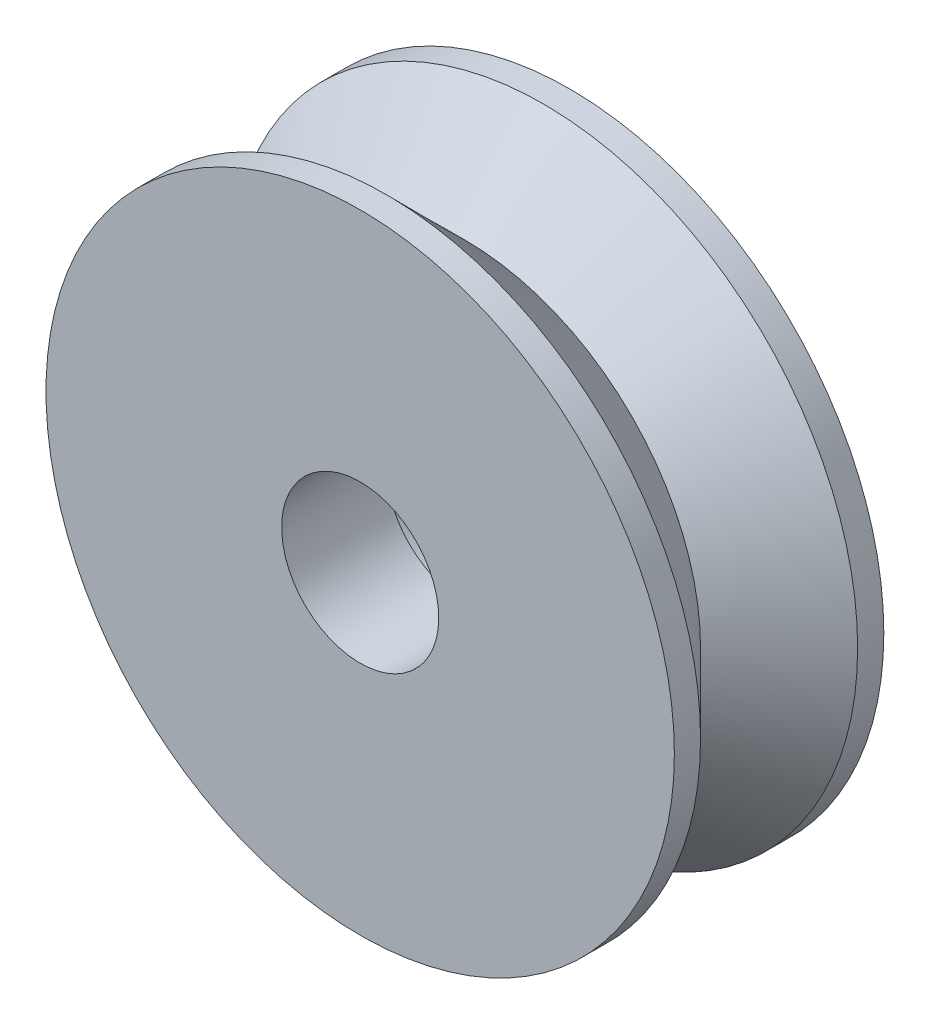
ISO-10303-21;
HEADER;
FILE_DESCRIPTION(('STEP AP214'),'2;1');
FILE_NAME('part.step','',(''),(''),'','','');
FILE_SCHEMA(('AUTOMOTIVE_DESIGN { 1 0 10303 214 1 1 1 1 }'));
ENDSEC;
DATA;
#1=APPLICATION_CONTEXT('core data for automotive mechanical design processes');
#2=APPLICATION_PROTOCOL_DEFINITION('international standard','automotive_design',2000,#1);
#3=PRODUCT_CONTEXT('',#1,'mechanical');
#4=PRODUCT('Part','Part','',(#3));
#5=PRODUCT_RELATED_PRODUCT_CATEGORY('part','',(#4));
#6=PRODUCT_DEFINITION_FORMATION('','',#4);
#7=PRODUCT_DEFINITION_CONTEXT('part definition',#1,'design');
#8=PRODUCT_DEFINITION('design','',#6,#7);
#9=PRODUCT_DEFINITION_SHAPE('','',#8);
#10=(LENGTH_UNIT() NAMED_UNIT(*) SI_UNIT(.MILLI.,.METRE.));
#11=(NAMED_UNIT(*) PLANE_ANGLE_UNIT() SI_UNIT($,.RADIAN.));
#12=(NAMED_UNIT(*) SI_UNIT($,.STERADIAN.) SOLID_ANGLE_UNIT());
#13=UNCERTAINTY_MEASURE_WITH_UNIT(LENGTH_MEASURE(1.E-05),#10,'distance_accuracy_value','');
#14=(GEOMETRIC_REPRESENTATION_CONTEXT(3) GLOBAL_UNCERTAINTY_ASSIGNED_CONTEXT((#13)) GLOBAL_UNIT_ASSIGNED_CONTEXT((#10,
#11,#12)) REPRESENTATION_CONTEXT('',''));
#15=CARTESIAN_POINT('',(0.,0.,0.));
#16=DIRECTION('',(0.,0.,1.));
#17=DIRECTION('',(1.,0.,0.));
#18=AXIS2_PLACEMENT_3D('',#15,#16,#17);
#19=CARTESIAN_POINT('',(0.,0.,0.));
#20=DIRECTION('',(0.,0.,1.));
#21=DIRECTION('',(1.,0.,0.));
#22=AXIS2_PLACEMENT_3D('',#19,#20,#21);
#23=PLANE('',#22);
#24=CARTESIAN_POINT('',(0.,0.,0.));
#25=DIRECTION('',(0.,0.,1.));
#26=DIRECTION('',(1.,0.,0.));
#27=AXIS2_PLACEMENT_3D('',#24,#25,#26);
#28=CIRCLE('',#27,5.99999999999908);
#29=CARTESIAN_POINT('',(5.99999999999908,0.,0.));
#30=VERTEX_POINT('',#29);
#31=EDGE_CURVE('E45',#30,#30,#28,.T.);
#32=ORIENTED_EDGE('',*,*,#31,.F.);
#33=EDGE_LOOP('',(#32));
#34=FACE_BOUND('',#33,.T.);
#35=CARTESIAN_POINT('',(0.,0.,0.));
#36=DIRECTION('',(0.,0.,1.));
#37=DIRECTION('',(1.,0.,0.));
#38=AXIS2_PLACEMENT_3D('',#35,#36,#37);
#39=CIRCLE('',#38,1.9);
#40=CARTESIAN_POINT('',(1.9,0.,0.));
#41=VERTEX_POINT('',#40);
#42=EDGE_CURVE('E50',#41,#41,#39,.T.);
#43=ORIENTED_EDGE('',*,*,#42,.T.);
#44=EDGE_LOOP('',(#43));
#45=FACE_BOUND('',#44,.T.);
#46=ADVANCED_FACE('F30',(#34,#45),#23,.F.);
#47=CARTESIAN_POINT('',(0.,0.,2.));
#48=DIRECTION('',(0.,0.,-1.));
#49=DIRECTION('',(-1.,0.,0.));
#50=AXIS2_PLACEMENT_3D('',#47,#48,#49);
#51=CYLINDRICAL_SURFACE('',#50,5.99999999999908);
#52=CARTESIAN_POINT('',(0.,0.,0.499999999999999));
#53=DIRECTION('',(0.,0.,1.));
#54=DIRECTION('',(1.,0.,0.));
#55=AXIS2_PLACEMENT_3D('',#52,#53,#54);
#56=CIRCLE('',#55,5.99999999999908);
#57=CARTESIAN_POINT('',(5.99999999999908,0.,0.499999999999999));
#58=VERTEX_POINT('',#57);
#59=EDGE_CURVE('E37',#58,#58,#56,.F.);
#60=ORIENTED_EDGE('',*,*,#59,.T.);
#61=EDGE_LOOP('',(#60));
#62=FACE_BOUND('',#61,.T.);
#63=ORIENTED_EDGE('',*,*,#31,.T.);
#64=EDGE_LOOP('',(#63));
#65=FACE_BOUND('',#64,.T.);
#66=ADVANCED_FACE('F85',(#62,#65),#51,.T.);
#67=CARTESIAN_POINT('',(0.,0.,2.));
#68=DIRECTION('',(0.,0.,-1.));
#69=DIRECTION('',(-1.,0.,0.));
#70=AXIS2_PLACEMENT_3D('',#67,#68,#69);
#71=CYLINDRICAL_SURFACE('',#70,1.9);
#72=CARTESIAN_POINT('',(0.,0.,2.));
#73=DIRECTION('',(0.,0.,1.));
#74=DIRECTION('',(1.,0.,0.));
#75=AXIS2_PLACEMENT_3D('',#72,#73,#74);
#76=CIRCLE('',#75,1.9);
#77=CARTESIAN_POINT('',(1.9,0.,2.));
#78=VERTEX_POINT('',#77);
#79=EDGE_CURVE('E53',#78,#78,#76,.T.);
#80=ORIENTED_EDGE('',*,*,#79,.T.);
#81=EDGE_LOOP('',(#80));
#82=FACE_BOUND('',#81,.T.);
#83=ORIENTED_EDGE('',*,*,#42,.F.);
#84=EDGE_LOOP('',(#83));
#85=FACE_BOUND('',#84,.T.);
#86=ADVANCED_FACE('F91',(#82,#85),#71,.F.);
#87=CARTESIAN_POINT('',(0.,0.,2.));
#88=DIRECTION('',(0.,0.,-1.));
#89=DIRECTION('',(-1.,0.,0.));
#90=AXIS2_PLACEMENT_3D('',#87,#88,#89);
#91=CONICAL_SURFACE('',#90,4.49999999999909,0.785398163397447);
#92=ORIENTED_EDGE('',*,*,#59,.F.);
#93=EDGE_LOOP('',(#92));
#94=FACE_BOUND('',#93,.T.);
#95=CARTESIAN_POINT('',(0.,0.,2.));
#96=DIRECTION('',(0.,0.,1.));
#97=DIRECTION('',(1.,0.,0.));
#98=AXIS2_PLACEMENT_3D('',#95,#96,#97);
#99=CIRCLE('',#98,4.49999999999909);
#100=CARTESIAN_POINT('',(4.49999999999909,0.,2.));
#101=VERTEX_POINT('',#100);
#102=EDGE_CURVE('E41',#101,#101,#99,.T.);
#103=ORIENTED_EDGE('',*,*,#102,.F.);
#104=EDGE_LOOP('',(#103));
#105=FACE_BOUND('',#104,.T.);
#106=ADVANCED_FACE('F80',(#94,#105),#91,.T.);
#107=CARTESIAN_POINT('',(0.,0.,2.));
#108=DIRECTION('',(0.,0.,1.));
#109=DIRECTION('',(1.,0.,0.));
#110=AXIS2_PLACEMENT_3D('',#107,#108,#109);
#111=PLANE('',#110);
#112=ORIENTED_EDGE('',*,*,#79,.F.);
#113=EDGE_LOOP('',(#112));
#114=FACE_BOUND('',#113,.T.);
#115=CARTESIAN_POINT('',(0.,0.,2.));
#116=DIRECTION('',(0.,0.,1.));
#117=DIRECTION('',(1.,0.,0.));
#118=AXIS2_PLACEMENT_3D('',#115,#116,#117);
#119=CIRCLE('',#118,1.5);
#120=CARTESIAN_POINT('',(1.5,0.,2.));
#121=VERTEX_POINT('',#120);
#122=EDGE_CURVE('E60',#121,#121,#119,.T.);
#123=ORIENTED_EDGE('',*,*,#122,.T.);
#124=EDGE_LOOP('',(#123));
#125=FACE_BOUND('',#124,.T.);
#126=ADVANCED_FACE('F72',(#114,#125),#111,.F.);
#127=CARTESIAN_POINT('',(0.,0.,4.));
#128=DIRECTION('',(0.,0.,1.));
#129=DIRECTION('',(1.,0.,0.));
#130=AXIS2_PLACEMENT_3D('',#127,#128,#129);
#131=PLANE('',#130);
#132=CARTESIAN_POINT('',(0.,0.,4.));
#133=DIRECTION('',(0.,0.,1.));
#134=DIRECTION('',(1.,0.,0.));
#135=AXIS2_PLACEMENT_3D('',#132,#133,#134);
#136=CIRCLE('',#135,5.99999999999908);
#137=CARTESIAN_POINT('',(5.99999999999908,0.,4.));
#138=VERTEX_POINT('',#137);
#139=EDGE_CURVE('E56',#138,#138,#136,.T.);
#140=ORIENTED_EDGE('',*,*,#139,.T.);
#141=EDGE_LOOP('',(#140));
#142=FACE_BOUND('',#141,.T.);
#143=CARTESIAN_POINT('',(0.,0.,4.));
#144=DIRECTION('',(0.,0.,1.));
#145=DIRECTION('',(1.,0.,0.));
#146=AXIS2_PLACEMENT_3D('',#143,#144,#145);
#147=CIRCLE('',#146,1.5);
#148=CARTESIAN_POINT('',(1.5,0.,4.));
#149=VERTEX_POINT('',#148);
#150=EDGE_CURVE('E59',#149,#149,#147,.T.);
#151=ORIENTED_EDGE('',*,*,#150,.F.);
#152=EDGE_LOOP('',(#151));
#153=FACE_BOUND('',#152,.T.);
#154=ADVANCED_FACE('F69',(#142,#153),#131,.T.);
#155=CARTESIAN_POINT('',(0.,0.,4.));
#156=DIRECTION('',(0.,0.,-1.));
#157=DIRECTION('',(-1.,0.,0.));
#158=AXIS2_PLACEMENT_3D('',#155,#156,#157);
#159=CYLINDRICAL_SURFACE('',#158,5.99999999999908);
#160=CARTESIAN_POINT('',(0.,0.,3.5));
#161=DIRECTION('',(0.,0.,1.));
#162=DIRECTION('',(1.,0.,0.));
#163=AXIS2_PLACEMENT_3D('',#160,#161,#162);
#164=CIRCLE('',#163,5.99999999999908);
#165=CARTESIAN_POINT('',(5.99999999999908,0.,3.5));
#166=VERTEX_POINT('',#165);
#167=EDGE_CURVE('E10',#166,#166,#164,.T.);
#168=ORIENTED_EDGE('',*,*,#167,.T.);
#169=EDGE_LOOP('',(#168));
#170=FACE_BOUND('',#169,.T.);
#171=ORIENTED_EDGE('',*,*,#139,.F.);
#172=EDGE_LOOP('',(#171));
#173=FACE_BOUND('',#172,.T.);
#174=ADVANCED_FACE('F71',(#170,#173),#159,.T.);
#175=CARTESIAN_POINT('',(0.,0.,4.));
#176=DIRECTION('',(0.,0.,-1.));
#177=DIRECTION('',(-1.,0.,0.));
#178=AXIS2_PLACEMENT_3D('',#175,#176,#177);
#179=CYLINDRICAL_SURFACE('',#178,1.5);
#180=ORIENTED_EDGE('',*,*,#150,.T.);
#181=EDGE_LOOP('',(#180));
#182=FACE_BOUND('',#181,.T.);
#183=ORIENTED_EDGE('',*,*,#122,.F.);
#184=EDGE_LOOP('',(#183));
#185=FACE_BOUND('',#184,.T.);
#186=ADVANCED_FACE('F66',(#182,#185),#179,.F.);
#187=CARTESIAN_POINT('',(0.,0.,3.5));
#188=DIRECTION('',(0.,0.,1.));
#189=DIRECTION('',(1.,0.,0.));
#190=AXIS2_PLACEMENT_3D('',#187,#188,#189);
#191=CONICAL_SURFACE('',#190,5.99999999999908,0.785398163397451);
#192=ORIENTED_EDGE('',*,*,#102,.T.);
#193=EDGE_LOOP('',(#192));
#194=FACE_BOUND('',#193,.T.);
#195=ORIENTED_EDGE('',*,*,#167,.F.);
#196=EDGE_LOOP('',(#195));
#197=FACE_BOUND('',#196,.T.);
#198=ADVANCED_FACE('F32',(#194,#197),#191,.T.);
#199=CLOSED_SHELL('',(#46,#66,#86,#106,#126,#154,#174,#186,#198));
#200=MANIFOLD_SOLID_BREP('B2',#199);
#201=ADVANCED_BREP_SHAPE_REPRESENTATION('',(#18,#200),#14);
#202=SHAPE_DEFINITION_REPRESENTATION(#9,#201);
ENDSEC;
END-ISO-10303-21;
